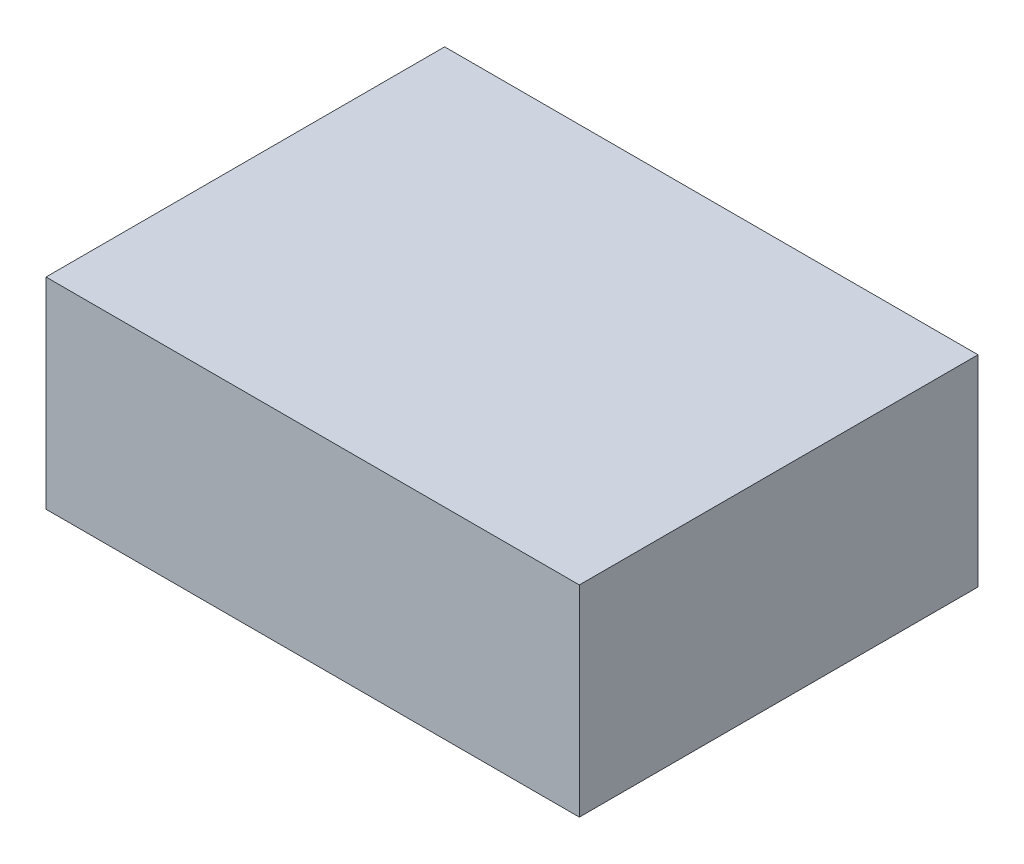
ISO-10303-21;
HEADER;
FILE_DESCRIPTION(('STEP AP214'),'2;1');
FILE_NAME('part.step','',(''),(''),'','','');
FILE_SCHEMA(('AUTOMOTIVE_DESIGN { 1 0 10303 214 1 1 1 1 }'));
ENDSEC;
DATA;
#1=APPLICATION_CONTEXT('core data for automotive mechanical design processes');
#2=APPLICATION_PROTOCOL_DEFINITION('international standard','automotive_design',2000,#1);
#3=PRODUCT_CONTEXT('',#1,'mechanical');
#4=PRODUCT('Part','Part','',(#3));
#5=PRODUCT_RELATED_PRODUCT_CATEGORY('part','',(#4));
#6=PRODUCT_DEFINITION_FORMATION('','',#4);
#7=PRODUCT_DEFINITION_CONTEXT('part definition',#1,'design');
#8=PRODUCT_DEFINITION('design','',#6,#7);
#9=PRODUCT_DEFINITION_SHAPE('','',#8);
#10=(LENGTH_UNIT() NAMED_UNIT(*) SI_UNIT(.MILLI.,.METRE.));
#11=(NAMED_UNIT(*) PLANE_ANGLE_UNIT() SI_UNIT($,.RADIAN.));
#12=(NAMED_UNIT(*) SI_UNIT($,.STERADIAN.) SOLID_ANGLE_UNIT());
#13=UNCERTAINTY_MEASURE_WITH_UNIT(LENGTH_MEASURE(1.E-05),#10,'distance_accuracy_value','');
#14=(GEOMETRIC_REPRESENTATION_CONTEXT(3) GLOBAL_UNCERTAINTY_ASSIGNED_CONTEXT((#13)) GLOBAL_UNIT_ASSIGNED_CONTEXT((#10,
#11,#12)) REPRESENTATION_CONTEXT('',''));
#15=CARTESIAN_POINT('',(0.,0.,0.));
#16=DIRECTION('',(0.,0.,1.));
#17=DIRECTION('',(1.,0.,0.));
#18=AXIS2_PLACEMENT_3D('',#15,#16,#17);
#19=CARTESIAN_POINT('',(0.,2.8448,0.));
#20=DIRECTION('',(1.,0.,0.));
#21=DIRECTION('',(0.,0.,-1.));
#22=AXIS2_PLACEMENT_3D('',#19,#20,#21);
#23=PLANE('',#22);
#24=DIRECTION('',(0.,0.,1.));
#25=VECTOR('',#24,1.);
#26=CARTESIAN_POINT('',(0.,0.,0.));
#27=LINE('',#26,#25);
#28=CARTESIAN_POINT('',(0.,0.,-5.6388));
#29=VERTEX_POINT('',#28);
#30=CARTESIAN_POINT('',(0.,0.,0.));
#31=VERTEX_POINT('',#30);
#32=EDGE_CURVE('E96',#29,#31,#27,.T.);
#33=ORIENTED_EDGE('',*,*,#32,.T.);
#34=DIRECTION('',(0.,-1.,0.));
#35=VECTOR('',#34,1.);
#36=CARTESIAN_POINT('',(0.,2.8448,0.));
#37=LINE('',#36,#35);
#38=CARTESIAN_POINT('',(0.,2.8448,0.));
#39=VERTEX_POINT('',#38);
#40=EDGE_CURVE('E11',#39,#31,#37,.T.);
#41=ORIENTED_EDGE('',*,*,#40,.F.);
#42=DIRECTION('',(0.,0.,1.));
#43=VECTOR('',#42,1.);
#44=CARTESIAN_POINT('',(0.,2.8448,0.));
#45=LINE('',#44,#43);
#46=CARTESIAN_POINT('',(0.,2.8448,-5.6388));
#47=VERTEX_POINT('',#46);
#48=EDGE_CURVE('E84',#47,#39,#45,.T.);
#49=ORIENTED_EDGE('',*,*,#48,.F.);
#50=DIRECTION('',(0.,-1.,0.));
#51=VECTOR('',#50,1.);
#52=CARTESIAN_POINT('',(0.,2.8448,-5.6388));
#53=LINE('',#52,#51);
#54=EDGE_CURVE('E92',#47,#29,#53,.T.);
#55=ORIENTED_EDGE('',*,*,#54,.T.);
#56=EDGE_LOOP('',(#33,#41,#49,#55));
#57=FACE_BOUND('',#56,.T.);
#58=ADVANCED_FACE('F33',(#57),#23,.F.);
#59=CARTESIAN_POINT('',(0.,2.8448,0.));
#60=DIRECTION('',(0.,0.,-1.));
#61=DIRECTION('',(-1.,0.,0.));
#62=AXIS2_PLACEMENT_3D('',#59,#60,#61);
#63=PLANE('',#62);
#64=DIRECTION('',(1.,0.,0.));
#65=VECTOR('',#64,1.);
#66=CARTESIAN_POINT('',(0.,0.,0.));
#67=LINE('',#66,#65);
#68=CARTESIAN_POINT('',(7.5438,0.,0.));
#69=VERTEX_POINT('',#68);
#70=EDGE_CURVE('E88',#31,#69,#67,.T.);
#71=ORIENTED_EDGE('',*,*,#70,.T.);
#72=DIRECTION('',(0.,-1.,0.));
#73=VECTOR('',#72,1.);
#74=CARTESIAN_POINT('',(7.5438,2.8448,0.));
#75=LINE('',#74,#73);
#76=CARTESIAN_POINT('',(7.5438,2.8448,0.));
#77=VERTEX_POINT('',#76);
#78=EDGE_CURVE('E41',#77,#69,#75,.T.);
#79=ORIENTED_EDGE('',*,*,#78,.F.);
#80=DIRECTION('',(1.,0.,0.));
#81=VECTOR('',#80,1.);
#82=CARTESIAN_POINT('',(0.,2.8448,0.));
#83=LINE('',#82,#81);
#84=EDGE_CURVE('E79',#39,#77,#83,.T.);
#85=ORIENTED_EDGE('',*,*,#84,.F.);
#86=ORIENTED_EDGE('',*,*,#40,.T.);
#87=EDGE_LOOP('',(#71,#79,#85,#86));
#88=FACE_BOUND('',#87,.T.);
#89=ADVANCED_FACE('F87',(#88),#63,.F.);
#90=CARTESIAN_POINT('',(7.5438,2.8448,0.));
#91=DIRECTION('',(-1.,0.,0.));
#92=DIRECTION('',(0.,0.,1.));
#93=AXIS2_PLACEMENT_3D('',#90,#91,#92);
#94=PLANE('',#93);
#95=DIRECTION('',(0.,0.,-1.));
#96=VECTOR('',#95,1.);
#97=CARTESIAN_POINT('',(7.5438,0.,0.));
#98=LINE('',#97,#96);
#99=CARTESIAN_POINT('',(7.5438,0.,-5.6388));
#100=VERTEX_POINT('',#99);
#101=EDGE_CURVE('E66',#69,#100,#98,.T.);
#102=ORIENTED_EDGE('',*,*,#101,.T.);
#103=DIRECTION('',(0.,-1.,0.));
#104=VECTOR('',#103,1.);
#105=CARTESIAN_POINT('',(7.5438,2.8448,-5.6388));
#106=LINE('',#105,#104);
#107=CARTESIAN_POINT('',(7.5438,2.8448,-5.6388));
#108=VERTEX_POINT('',#107);
#109=EDGE_CURVE('E89',#108,#100,#106,.T.);
#110=ORIENTED_EDGE('',*,*,#109,.F.);
#111=DIRECTION('',(0.,0.,-1.));
#112=VECTOR('',#111,1.);
#113=CARTESIAN_POINT('',(7.5438,2.8448,0.));
#114=LINE('',#113,#112);
#115=EDGE_CURVE('E82',#77,#108,#114,.T.);
#116=ORIENTED_EDGE('',*,*,#115,.F.);
#117=ORIENTED_EDGE('',*,*,#78,.T.);
#118=EDGE_LOOP('',(#102,#110,#116,#117));
#119=FACE_BOUND('',#118,.T.);
#120=ADVANCED_FACE('F90',(#119),#94,.F.);
#121=CARTESIAN_POINT('',(0.,2.8448,-5.6388));
#122=DIRECTION('',(0.,0.,1.));
#123=DIRECTION('',(1.,0.,0.));
#124=AXIS2_PLACEMENT_3D('',#121,#122,#123);
#125=PLANE('',#124);
#126=DIRECTION('',(-1.,0.,0.));
#127=VECTOR('',#126,1.);
#128=CARTESIAN_POINT('',(0.,0.,-5.6388));
#129=LINE('',#128,#127);
#130=EDGE_CURVE('E72',#100,#29,#129,.T.);
#131=ORIENTED_EDGE('',*,*,#130,.T.);
#132=ORIENTED_EDGE('',*,*,#54,.F.);
#133=DIRECTION('',(-1.,0.,0.));
#134=VECTOR('',#133,1.);
#135=CARTESIAN_POINT('',(0.,2.8448,-5.6388));
#136=LINE('',#135,#134);
#137=EDGE_CURVE('E49',#108,#47,#136,.T.);
#138=ORIENTED_EDGE('',*,*,#137,.F.);
#139=ORIENTED_EDGE('',*,*,#109,.T.);
#140=EDGE_LOOP('',(#131,#132,#138,#139));
#141=FACE_BOUND('',#140,.T.);
#142=ADVANCED_FACE('F103',(#141),#125,.F.);
#143=CARTESIAN_POINT('',(0.,2.8448,0.));
#144=DIRECTION('',(0.,-1.,0.));
#145=DIRECTION('',(0.,0.,-1.));
#146=AXIS2_PLACEMENT_3D('',#143,#144,#145);
#147=PLANE('',#146);
#148=ORIENTED_EDGE('',*,*,#48,.T.);
#149=ORIENTED_EDGE('',*,*,#84,.T.);
#150=ORIENTED_EDGE('',*,*,#115,.T.);
#151=ORIENTED_EDGE('',*,*,#137,.T.);
#152=EDGE_LOOP('',(#148,#149,#150,#151));
#153=FACE_BOUND('',#152,.T.);
#154=ADVANCED_FACE('F80',(#153),#147,.F.);
#155=CARTESIAN_POINT('',(0.,0.,0.));
#156=DIRECTION('',(0.,-1.,0.));
#157=DIRECTION('',(0.,0.,-1.));
#158=AXIS2_PLACEMENT_3D('',#155,#156,#157);
#159=PLANE('',#158);
#160=ORIENTED_EDGE('',*,*,#32,.F.);
#161=ORIENTED_EDGE('',*,*,#130,.F.);
#162=ORIENTED_EDGE('',*,*,#101,.F.);
#163=ORIENTED_EDGE('',*,*,#70,.F.);
#164=EDGE_LOOP('',(#160,#161,#162,#163));
#165=FACE_BOUND('',#164,.T.);
#166=ADVANCED_FACE('F106',(#165),#159,.T.);
#167=CLOSED_SHELL('',(#58,#89,#120,#142,#154,#166));
#168=MANIFOLD_SOLID_BREP('B2',#167);
#169=ADVANCED_BREP_SHAPE_REPRESENTATION('',(#18,#168),#14);
#170=SHAPE_DEFINITION_REPRESENTATION(#9,#169);
ENDSEC;
END-ISO-10303-21;
